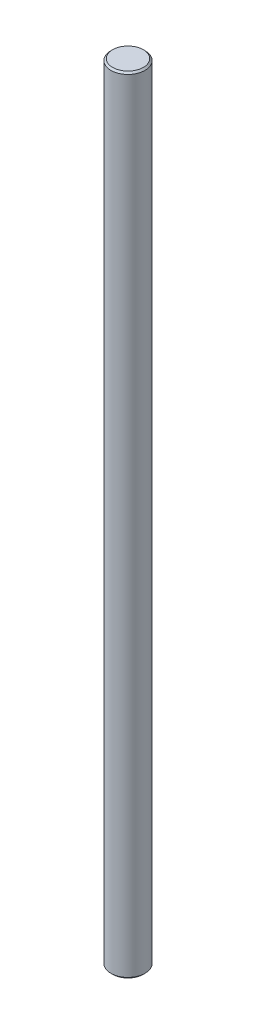
ISO-10303-21;
HEADER;
FILE_DESCRIPTION(('STEP AP214'),'2;1');
FILE_NAME('part.step','',(''),(''),'','','');
FILE_SCHEMA(('AUTOMOTIVE_DESIGN { 1 0 10303 214 1 1 1 1 }'));
ENDSEC;
DATA;
#1=APPLICATION_CONTEXT('core data for automotive mechanical design processes');
#2=APPLICATION_PROTOCOL_DEFINITION('international standard','automotive_design',2000,#1);
#3=PRODUCT_CONTEXT('',#1,'mechanical');
#4=PRODUCT('Part','Part','',(#3));
#5=PRODUCT_RELATED_PRODUCT_CATEGORY('part','',(#4));
#6=PRODUCT_DEFINITION_FORMATION('','',#4);
#7=PRODUCT_DEFINITION_CONTEXT('part definition',#1,'design');
#8=PRODUCT_DEFINITION('design','',#6,#7);
#9=PRODUCT_DEFINITION_SHAPE('','',#8);
#10=(LENGTH_UNIT() NAMED_UNIT(*) SI_UNIT(.MILLI.,.METRE.));
#11=(NAMED_UNIT(*) PLANE_ANGLE_UNIT() SI_UNIT($,.RADIAN.));
#12=(NAMED_UNIT(*) SI_UNIT($,.STERADIAN.) SOLID_ANGLE_UNIT());
#13=UNCERTAINTY_MEASURE_WITH_UNIT(LENGTH_MEASURE(1.E-05),#10,'distance_accuracy_value','');
#14=(GEOMETRIC_REPRESENTATION_CONTEXT(3) GLOBAL_UNCERTAINTY_ASSIGNED_CONTEXT((#13)) GLOBAL_UNIT_ASSIGNED_CONTEXT((#10,
#11,#12)) REPRESENTATION_CONTEXT('',''));
#15=CARTESIAN_POINT('',(0.,0.,0.));
#16=DIRECTION('',(0.,0.,1.));
#17=DIRECTION('',(1.,0.,0.));
#18=AXIS2_PLACEMENT_3D('',#15,#16,#17);
#19=CARTESIAN_POINT('',(0.,230.,0.));
#20=DIRECTION('',(0.,-1.,0.));
#21=DIRECTION('',(0.,0.,-1.));
#22=AXIS2_PLACEMENT_3D('',#19,#20,#21);
#23=CYLINDRICAL_SURFACE('',#22,5.);
#24=CARTESIAN_POINT('',(0.,0.500000000000028,0.));
#25=DIRECTION('',(0.,1.,0.));
#26=DIRECTION('',(0.,0.,1.));
#27=AXIS2_PLACEMENT_3D('',#24,#25,#26);
#28=CIRCLE('',#27,5.);
#29=CARTESIAN_POINT('',(0.,0.500000000000028,5.));
#30=VERTEX_POINT('',#29);
#31=EDGE_CURVE('E46',#30,#30,#28,.T.);
#32=ORIENTED_EDGE('',*,*,#31,.T.);
#33=EDGE_LOOP('',(#32));
#34=FACE_BOUND('',#33,.T.);
#35=CARTESIAN_POINT('',(0.,229.5,0.));
#36=DIRECTION('',(0.,1.,0.));
#37=DIRECTION('',(0.,0.,1.));
#38=AXIS2_PLACEMENT_3D('',#35,#36,#37);
#39=CIRCLE('',#38,5.);
#40=CARTESIAN_POINT('',(0.,229.5,5.));
#41=VERTEX_POINT('',#40);
#42=EDGE_CURVE('E50',#41,#41,#39,.F.);
#43=ORIENTED_EDGE('',*,*,#42,.T.);
#44=EDGE_LOOP('',(#43));
#45=FACE_BOUND('',#44,.T.);
#46=ADVANCED_FACE('F34',(#34,#45),#23,.T.);
#47=CARTESIAN_POINT('',(0.,230.,0.));
#48=DIRECTION('',(0.,1.,0.));
#49=DIRECTION('',(0.,0.,1.));
#50=AXIS2_PLACEMENT_3D('',#47,#48,#49);
#51=PLANE('',#50);
#52=CARTESIAN_POINT('',(0.,230.,0.));
#53=DIRECTION('',(0.,1.,0.));
#54=DIRECTION('',(0.,0.,1.));
#55=AXIS2_PLACEMENT_3D('',#52,#53,#54);
#56=CIRCLE('',#55,4.50000000000003);
#57=CARTESIAN_POINT('',(0.,230.,4.50000000000003));
#58=VERTEX_POINT('',#57);
#59=EDGE_CURVE('E10',#58,#58,#56,.T.);
#60=ORIENTED_EDGE('',*,*,#59,.T.);
#61=EDGE_LOOP('',(#60));
#62=FACE_BOUND('',#61,.T.);
#63=ADVANCED_FACE('F66',(#62),#51,.T.);
#64=CARTESIAN_POINT('',(0.,0.,0.));
#65=DIRECTION('',(0.,1.,0.));
#66=DIRECTION('',(0.,0.,1.));
#67=AXIS2_PLACEMENT_3D('',#64,#65,#66);
#68=PLANE('',#67);
#69=CARTESIAN_POINT('',(0.,0.,0.));
#70=DIRECTION('',(0.,1.,0.));
#71=DIRECTION('',(0.,0.,1.));
#72=AXIS2_PLACEMENT_3D('',#69,#70,#71);
#73=CIRCLE('',#72,4.49999999999995);
#74=CARTESIAN_POINT('',(0.,0.,4.49999999999995));
#75=VERTEX_POINT('',#74);
#76=EDGE_CURVE('E42',#75,#75,#73,.F.);
#77=ORIENTED_EDGE('',*,*,#76,.T.);
#78=EDGE_LOOP('',(#77));
#79=FACE_BOUND('',#78,.T.);
#80=ADVANCED_FACE('F63',(#79),#68,.F.);
#81=CARTESIAN_POINT('',(0.,0.500000000000028,0.));
#82=DIRECTION('',(0.,1.,0.));
#83=DIRECTION('',(0.,0.,1.));
#84=AXIS2_PLACEMENT_3D('',#81,#82,#83);
#85=CONICAL_SURFACE('',#84,5.,0.785398163397471);
#86=ORIENTED_EDGE('',*,*,#76,.F.);
#87=EDGE_LOOP('',(#86));
#88=FACE_BOUND('',#87,.T.);
#89=ORIENTED_EDGE('',*,*,#31,.F.);
#90=EDGE_LOOP('',(#89));
#91=FACE_BOUND('',#90,.T.);
#92=ADVANCED_FACE('F59',(#88,#91),#85,.T.);
#93=CARTESIAN_POINT('',(0.,230.,0.));
#94=DIRECTION('',(0.,-1.,0.));
#95=DIRECTION('',(0.,0.,-1.));
#96=AXIS2_PLACEMENT_3D('',#93,#94,#95);
#97=CONICAL_SURFACE('',#96,4.50000000000003,0.785398163397443);
#98=ORIENTED_EDGE('',*,*,#42,.F.);
#99=EDGE_LOOP('',(#98));
#100=FACE_BOUND('',#99,.T.);
#101=ORIENTED_EDGE('',*,*,#59,.F.);
#102=EDGE_LOOP('',(#101));
#103=FACE_BOUND('',#102,.T.);
#104=ADVANCED_FACE('F37',(#100,#103),#97,.T.);
#105=CLOSED_SHELL('',(#46,#63,#80,#92,#104));
#106=MANIFOLD_SOLID_BREP('B2',#105);
#107=ADVANCED_BREP_SHAPE_REPRESENTATION('',(#18,#106),#14);
#108=SHAPE_DEFINITION_REPRESENTATION(#9,#107);
ENDSEC;
END-ISO-10303-21;
